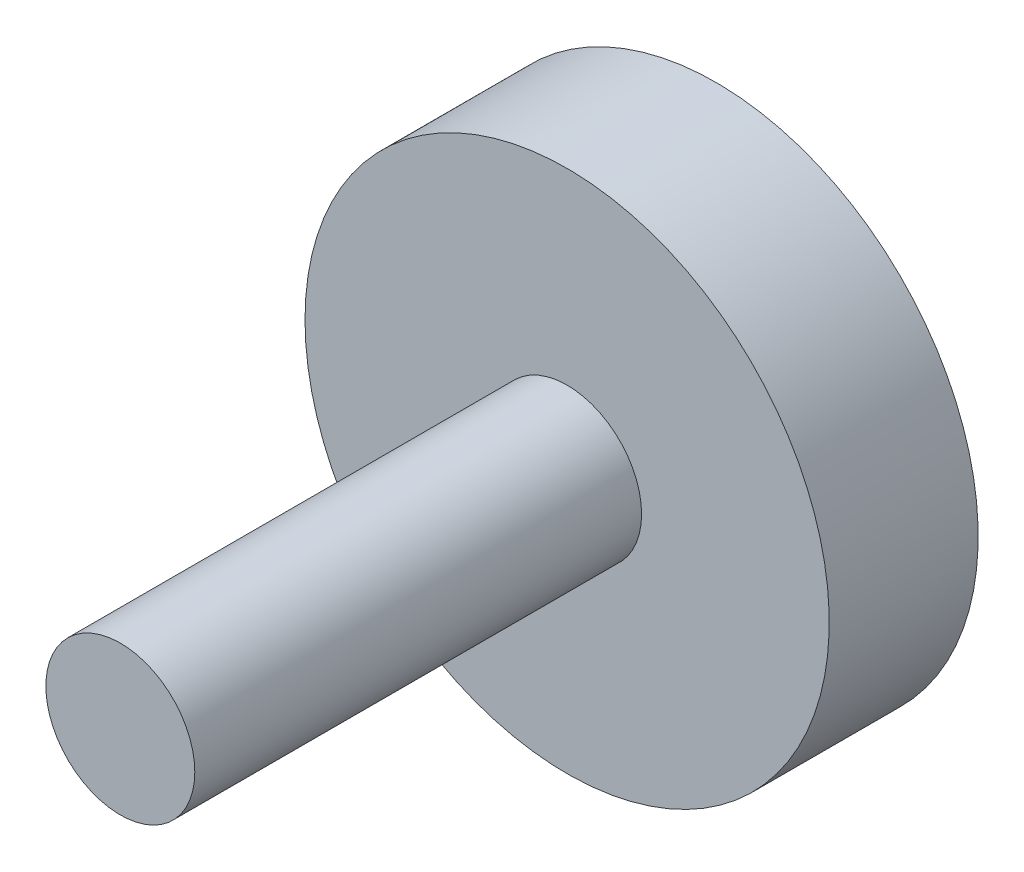
ISO-10303-21;
HEADER;
FILE_DESCRIPTION(('STEP AP214'),'2;1');
FILE_NAME('part.step','',(''),(''),'','','');
FILE_SCHEMA(('AUTOMOTIVE_DESIGN { 1 0 10303 214 1 1 1 1 }'));
ENDSEC;
DATA;
#1=APPLICATION_CONTEXT('core data for automotive mechanical design processes');
#2=APPLICATION_PROTOCOL_DEFINITION('international standard','automotive_design',2000,#1);
#3=PRODUCT_CONTEXT('',#1,'mechanical');
#4=PRODUCT('Part','Part','',(#3));
#5=PRODUCT_RELATED_PRODUCT_CATEGORY('part','',(#4));
#6=PRODUCT_DEFINITION_FORMATION('','',#4);
#7=PRODUCT_DEFINITION_CONTEXT('part definition',#1,'design');
#8=PRODUCT_DEFINITION('design','',#6,#7);
#9=PRODUCT_DEFINITION_SHAPE('','',#8);
#10=(LENGTH_UNIT() NAMED_UNIT(*) SI_UNIT(.MILLI.,.METRE.));
#11=(NAMED_UNIT(*) PLANE_ANGLE_UNIT() SI_UNIT($,.RADIAN.));
#12=(NAMED_UNIT(*) SI_UNIT($,.STERADIAN.) SOLID_ANGLE_UNIT());
#13=UNCERTAINTY_MEASURE_WITH_UNIT(LENGTH_MEASURE(1.E-05),#10,'distance_accuracy_value','');
#14=(GEOMETRIC_REPRESENTATION_CONTEXT(3) GLOBAL_UNCERTAINTY_ASSIGNED_CONTEXT((#13)) GLOBAL_UNIT_ASSIGNED_CONTEXT((#10,
#11,#12)) REPRESENTATION_CONTEXT('',''));
#15=CARTESIAN_POINT('',(0.,0.,0.));
#16=DIRECTION('',(0.,0.,1.));
#17=DIRECTION('',(1.,0.,0.));
#18=AXIS2_PLACEMENT_3D('',#15,#16,#17);
#19=CARTESIAN_POINT('',(0.,0.,30.));
#20=DIRECTION('',(0.,0.,-1.));
#21=DIRECTION('',(-1.,0.,0.));
#22=AXIS2_PLACEMENT_3D('',#19,#20,#21);
#23=CYLINDRICAL_SURFACE('',#22,5.);
#24=CARTESIAN_POINT('',(0.,0.,30.));
#25=DIRECTION('',(0.,0.,1.));
#26=DIRECTION('',(1.,0.,0.));
#27=AXIS2_PLACEMENT_3D('',#24,#25,#26);
#28=CIRCLE('',#27,5.);
#29=CARTESIAN_POINT('',(5.,0.,30.));
#30=VERTEX_POINT('',#29);
#31=EDGE_CURVE('E10',#30,#30,#28,.T.);
#32=ORIENTED_EDGE('',*,*,#31,.F.);
#33=EDGE_LOOP('',(#32));
#34=FACE_BOUND('',#33,.T.);
#35=CARTESIAN_POINT('',(0.,0.,0.));
#36=DIRECTION('',(0.,0.,1.));
#37=DIRECTION('',(1.,0.,0.));
#38=AXIS2_PLACEMENT_3D('',#35,#36,#37);
#39=CIRCLE('',#38,5.);
#40=CARTESIAN_POINT('',(5.,0.,0.));
#41=VERTEX_POINT('',#40);
#42=EDGE_CURVE('E40',#41,#41,#39,.T.);
#43=ORIENTED_EDGE('',*,*,#42,.T.);
#44=EDGE_LOOP('',(#43));
#45=FACE_BOUND('',#44,.T.);
#46=ADVANCED_FACE('F37',(#34,#45),#23,.T.);
#47=CARTESIAN_POINT('',(0.,0.,30.));
#48=DIRECTION('',(0.,0.,1.));
#49=DIRECTION('',(1.,0.,0.));
#50=AXIS2_PLACEMENT_3D('',#47,#48,#49);
#51=PLANE('',#50);
#52=ORIENTED_EDGE('',*,*,#31,.T.);
#53=EDGE_LOOP('',(#52));
#54=FACE_BOUND('',#53,.T.);
#55=ADVANCED_FACE('F64',(#54),#51,.T.);
#56=CARTESIAN_POINT('',(0.,0.,-10.));
#57=DIRECTION('',(0.,0.,1.));
#58=DIRECTION('',(1.,0.,0.));
#59=AXIS2_PLACEMENT_3D('',#56,#57,#58);
#60=CYLINDRICAL_SURFACE('',#59,17.6);
#61=CARTESIAN_POINT('',(0.,0.,-10.));
#62=DIRECTION('',(0.,0.,-1.));
#63=DIRECTION('',(-1.,0.,0.));
#64=AXIS2_PLACEMENT_3D('',#61,#62,#63);
#65=CIRCLE('',#64,17.6);
#66=CARTESIAN_POINT('',(-17.6,0.,-10.));
#67=VERTEX_POINT('',#66);
#68=EDGE_CURVE('E49',#67,#67,#65,.T.);
#69=ORIENTED_EDGE('',*,*,#68,.F.);
#70=EDGE_LOOP('',(#69));
#71=FACE_BOUND('',#70,.T.);
#72=CARTESIAN_POINT('',(0.,0.,0.));
#73=DIRECTION('',(0.,0.,-1.));
#74=DIRECTION('',(-1.,0.,0.));
#75=AXIS2_PLACEMENT_3D('',#72,#73,#74);
#76=CIRCLE('',#75,17.6);
#77=CARTESIAN_POINT('',(-17.6,0.,0.));
#78=VERTEX_POINT('',#77);
#79=EDGE_CURVE('E51',#78,#78,#76,.T.);
#80=ORIENTED_EDGE('',*,*,#79,.T.);
#81=EDGE_LOOP('',(#80));
#82=FACE_BOUND('',#81,.T.);
#83=ADVANCED_FACE('F61',(#71,#82),#60,.T.);
#84=CARTESIAN_POINT('',(0.,0.,-10.));
#85=DIRECTION('',(0.,0.,-1.));
#86=DIRECTION('',(-1.,0.,0.));
#87=AXIS2_PLACEMENT_3D('',#84,#85,#86);
#88=PLANE('',#87);
#89=ORIENTED_EDGE('',*,*,#68,.T.);
#90=EDGE_LOOP('',(#89));
#91=FACE_BOUND('',#90,.T.);
#92=ADVANCED_FACE('F59',(#91),#88,.T.);
#93=CARTESIAN_POINT('',(0.,0.,0.));
#94=DIRECTION('',(0.,0.,-1.));
#95=DIRECTION('',(-1.,0.,0.));
#96=AXIS2_PLACEMENT_3D('',#93,#94,#95);
#97=PLANE('',#96);
#98=ORIENTED_EDGE('',*,*,#42,.F.);
#99=EDGE_LOOP('',(#98));
#100=FACE_BOUND('',#99,.T.);
#101=ORIENTED_EDGE('',*,*,#79,.F.);
#102=EDGE_LOOP('',(#101));
#103=FACE_BOUND('',#102,.T.);
#104=ADVANCED_FACE('F68',(#100,#103),#97,.F.);
#105=CLOSED_SHELL('',(#46,#55,#83,#92,#104));
#106=MANIFOLD_SOLID_BREP('B2',#105);
#107=ADVANCED_BREP_SHAPE_REPRESENTATION('',(#18,#106),#14);
#108=SHAPE_DEFINITION_REPRESENTATION(#9,#107);
ENDSEC;
END-ISO-10303-21;
